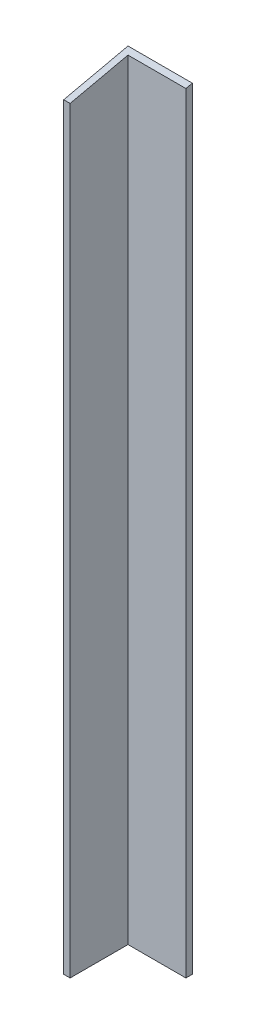
ISO-10303-21;
HEADER;
FILE_DESCRIPTION(('STEP AP214'),'2;1');
FILE_NAME('part.step','',(''),(''),'','','');
FILE_SCHEMA(('AUTOMOTIVE_DESIGN { 1 0 10303 214 1 1 1 1 }'));
ENDSEC;
DATA;
#1=APPLICATION_CONTEXT('core data for automotive mechanical design processes');
#2=APPLICATION_PROTOCOL_DEFINITION('international standard','automotive_design',2000,#1);
#3=PRODUCT_CONTEXT('',#1,'mechanical');
#4=PRODUCT('Part','Part','',(#3));
#5=PRODUCT_RELATED_PRODUCT_CATEGORY('part','',(#4));
#6=PRODUCT_DEFINITION_FORMATION('','',#4);
#7=PRODUCT_DEFINITION_CONTEXT('part definition',#1,'design');
#8=PRODUCT_DEFINITION('design','',#6,#7);
#9=PRODUCT_DEFINITION_SHAPE('','',#8);
#10=(LENGTH_UNIT() NAMED_UNIT(*) SI_UNIT(.MILLI.,.METRE.));
#11=(NAMED_UNIT(*) PLANE_ANGLE_UNIT() SI_UNIT($,.RADIAN.));
#12=(NAMED_UNIT(*) SI_UNIT($,.STERADIAN.) SOLID_ANGLE_UNIT());
#13=UNCERTAINTY_MEASURE_WITH_UNIT(LENGTH_MEASURE(1.E-05),#10,'distance_accuracy_value','');
#14=(GEOMETRIC_REPRESENTATION_CONTEXT(3) GLOBAL_UNCERTAINTY_ASSIGNED_CONTEXT((#13)) GLOBAL_UNIT_ASSIGNED_CONTEXT((#10,
#11,#12)) REPRESENTATION_CONTEXT('',''));
#15=CARTESIAN_POINT('',(0.,0.,0.));
#16=DIRECTION('',(0.,0.,1.));
#17=DIRECTION('',(1.,0.,0.));
#18=AXIS2_PLACEMENT_3D('',#15,#16,#17);
#19=CARTESIAN_POINT('',(-61.4626865671642,118.164179104478,-20.));
#20=DIRECTION('',(-1.,0.,0.));
#21=DIRECTION('',(0.,-1.,0.));
#22=AXIS2_PLACEMENT_3D('',#19,#20,#21);
#23=PLANE('',#22);
#24=DIRECTION('',(0.,-0.218143241396544,0.975916761938747));
#25=VECTOR('',#24,1.);
#26=CARTESIAN_POINT('',(-61.4626865671642,118.164179104478,-20.));
#27=LINE('',#26,#25);
#28=CARTESIAN_POINT('',(-61.4626865671642,118.164179104478,-20.));
#29=VERTEX_POINT('',#28);
#30=CARTESIAN_POINT('',(-61.4626865671642,113.693649446535,0.));
#31=VERTEX_POINT('',#30);
#32=EDGE_CURVE('E118',#29,#31,#27,.T.);
#33=ORIENTED_EDGE('',*,*,#32,.F.);
#34=DIRECTION('',(0.,-1.,0.));
#35=VECTOR('',#34,1.);
#36=CARTESIAN_POINT('',(-61.4626865671642,118.164179104478,-20.));
#37=LINE('',#36,#35);
#38=CARTESIAN_POINT('',(-61.4626865671642,-121.835820895522,-20.));
#39=VERTEX_POINT('',#38);
#40=EDGE_CURVE('E102',#29,#39,#37,.T.);
#41=ORIENTED_EDGE('',*,*,#40,.T.);
#42=DIRECTION('',(0.,0.,1.));
#43=VECTOR('',#42,1.);
#44=CARTESIAN_POINT('',(-61.4626865671642,-121.835820895522,-20.));
#45=LINE('',#44,#43);
#46=CARTESIAN_POINT('',(-61.4626865671642,-121.835820895522,0.));
#47=VERTEX_POINT('',#46);
#48=EDGE_CURVE('E112',#39,#47,#45,.T.);
#49=ORIENTED_EDGE('',*,*,#48,.T.);
#50=DIRECTION('',(0.,-1.,0.));
#51=VECTOR('',#50,1.);
#52=CARTESIAN_POINT('',(-61.4626865671642,118.164179104478,0.));
#53=LINE('',#52,#51);
#54=EDGE_CURVE('E100',#31,#47,#53,.T.);
#55=ORIENTED_EDGE('',*,*,#54,.F.);
#56=EDGE_LOOP('',(#33,#41,#49,#55));
#57=FACE_BOUND('',#56,.T.);
#58=ADVANCED_FACE('F33',(#57),#23,.T.);
#59=CARTESIAN_POINT('',(-41.4626865671642,118.164179104478,-20.));
#60=DIRECTION('',(1.,0.,0.));
#61=DIRECTION('',(0.,1.,0.));
#62=AXIS2_PLACEMENT_3D('',#59,#60,#61);
#63=PLANE('',#62);
#64=DIRECTION('',(0.,-1.,0.));
#65=VECTOR('',#64,1.);
#66=CARTESIAN_POINT('',(-41.4626865671648,168.164179104478,-18.));
#67=LINE('',#66,#65);
#68=CARTESIAN_POINT('',(-41.4626865671647,117.717126138683,-18.));
#69=VERTEX_POINT('',#68);
#70=CARTESIAN_POINT('',(-41.4626865671644,-121.835820895522,-18.));
#71=VERTEX_POINT('',#70);
#72=EDGE_CURVE('E133',#69,#71,#67,.T.);
#73=ORIENTED_EDGE('',*,*,#72,.T.);
#74=DIRECTION('',(0.,0.,1.));
#75=VECTOR('',#74,1.);
#76=CARTESIAN_POINT('',(-41.4626865671642,-121.835820895522,-20.));
#77=LINE('',#76,#75);
#78=CARTESIAN_POINT('',(-41.4626865671642,-121.835820895522,-20.));
#79=VERTEX_POINT('',#78);
#80=EDGE_CURVE('E110',#79,#71,#77,.T.);
#81=ORIENTED_EDGE('',*,*,#80,.F.);
#82=DIRECTION('',(0.,1.,0.));
#83=VECTOR('',#82,1.);
#84=CARTESIAN_POINT('',(-41.4626865671642,118.164179104478,-20.));
#85=LINE('',#84,#83);
#86=CARTESIAN_POINT('',(-41.4626865671642,118.164179104478,-20.));
#87=VERTEX_POINT('',#86);
#88=EDGE_CURVE('E126',#79,#87,#85,.T.);
#89=ORIENTED_EDGE('',*,*,#88,.T.);
#90=DIRECTION('',(0.,-0.218143241396544,0.975916761938747));
#91=VECTOR('',#90,1.);
#92=CARTESIAN_POINT('',(-41.4626865671642,118.164179104478,-20.));
#93=LINE('',#92,#91);
#94=EDGE_CURVE('E119',#87,#69,#93,.T.);
#95=ORIENTED_EDGE('',*,*,#94,.T.);
#96=EDGE_LOOP('',(#73,#81,#89,#95));
#97=FACE_BOUND('',#96,.T.);
#98=ADVANCED_FACE('F138',(#97),#63,.T.);
#99=CARTESIAN_POINT('',(-61.4626865671642,-121.835820895522,-20.));
#100=DIRECTION('',(0.,-1.,0.));
#101=DIRECTION('',(0.,0.,-1.));
#102=AXIS2_PLACEMENT_3D('',#99,#100,#101);
#103=PLANE('',#102);
#104=DIRECTION('',(1.,0.,0.));
#105=VECTOR('',#104,1.);
#106=CARTESIAN_POINT('',(-41.4626865671644,-121.835820895522,-18.));
#107=LINE('',#106,#105);
#108=CARTESIAN_POINT('',(-59.4626865671644,-121.835820895522,-18.));
#109=VERTEX_POINT('',#108);
#110=EDGE_CURVE('E90',#109,#71,#107,.T.);
#111=ORIENTED_EDGE('',*,*,#110,.F.);
#112=DIRECTION('',(0.,0.,-1.));
#113=VECTOR('',#112,1.);
#114=CARTESIAN_POINT('',(-59.4626865671644,-121.835820895522,0.));
#115=LINE('',#114,#113);
#116=CARTESIAN_POINT('',(-59.4626865671644,-121.835820895522,0.));
#117=VERTEX_POINT('',#116);
#118=EDGE_CURVE('E86',#117,#109,#115,.T.);
#119=ORIENTED_EDGE('',*,*,#118,.F.);
#120=DIRECTION('',(1.,0.,0.));
#121=VECTOR('',#120,1.);
#122=CARTESIAN_POINT('',(-61.4626865671642,-121.835820895522,0.));
#123=LINE('',#122,#121);
#124=EDGE_CURVE('E95',#47,#117,#123,.T.);
#125=ORIENTED_EDGE('',*,*,#124,.F.);
#126=ORIENTED_EDGE('',*,*,#48,.F.);
#127=DIRECTION('',(1.,0.,0.));
#128=VECTOR('',#127,1.);
#129=CARTESIAN_POINT('',(-61.4626865671642,-121.835820895522,-20.));
#130=LINE('',#129,#128);
#131=EDGE_CURVE('E105',#39,#79,#130,.T.);
#132=ORIENTED_EDGE('',*,*,#131,.T.);
#133=ORIENTED_EDGE('',*,*,#80,.T.);
#134=EDGE_LOOP('',(#111,#119,#125,#126,#132,#133));
#135=FACE_BOUND('',#134,.T.);
#136=ADVANCED_FACE('F94',(#135),#103,.T.);
#137=CARTESIAN_POINT('',(0.,0.,-20.));
#138=DIRECTION('',(0.,0.,1.));
#139=DIRECTION('',(1.,0.,0.));
#140=AXIS2_PLACEMENT_3D('',#137,#138,#139);
#141=PLANE('',#140);
#142=ORIENTED_EDGE('',*,*,#40,.F.);
#143=DIRECTION('',(-1.,0.,0.));
#144=VECTOR('',#143,1.);
#145=CARTESIAN_POINT('',(-61.4626865671642,118.164179104478,-20.));
#146=LINE('',#145,#144);
#147=EDGE_CURVE('E113',#87,#29,#146,.T.);
#148=ORIENTED_EDGE('',*,*,#147,.F.);
#149=ORIENTED_EDGE('',*,*,#88,.F.);
#150=ORIENTED_EDGE('',*,*,#131,.F.);
#151=EDGE_LOOP('',(#142,#148,#149,#150));
#152=FACE_BOUND('',#151,.T.);
#153=ADVANCED_FACE('F135',(#152),#141,.F.);
#154=CARTESIAN_POINT('',(0.,0.,0.));
#155=DIRECTION('',(0.,0.,1.));
#156=DIRECTION('',(1.,0.,0.));
#157=AXIS2_PLACEMENT_3D('',#154,#155,#156);
#158=PLANE('',#157);
#159=DIRECTION('',(0.,-1.,0.));
#160=VECTOR('',#159,1.);
#161=CARTESIAN_POINT('',(-59.4626865671648,168.164179104478,0.));
#162=LINE('',#161,#160);
#163=CARTESIAN_POINT('',(-59.4626865671647,113.693649446535,0.));
#164=VERTEX_POINT('',#163);
#165=EDGE_CURVE('E83',#164,#117,#162,.T.);
#166=ORIENTED_EDGE('',*,*,#165,.F.);
#167=DIRECTION('',(-1.,0.,0.));
#168=VECTOR('',#167,1.);
#169=CARTESIAN_POINT('',(-41.4626865671642,113.693649446535,0.));
#170=LINE('',#169,#168);
#171=EDGE_CURVE('E55',#164,#31,#170,.T.);
#172=ORIENTED_EDGE('',*,*,#171,.T.);
#173=ORIENTED_EDGE('',*,*,#54,.T.);
#174=ORIENTED_EDGE('',*,*,#124,.T.);
#175=EDGE_LOOP('',(#166,#172,#173,#174));
#176=FACE_BOUND('',#175,.T.);
#177=ADVANCED_FACE('F98',(#176),#158,.T.);
#178=CARTESIAN_POINT('',(-41.4626865671642,118.164179104478,-20.));
#179=DIRECTION('',(0.,-0.975916761938747,-0.218143241396544));
#180=DIRECTION('',(0.,0.218143241396544,-0.975916761938747));
#181=AXIS2_PLACEMENT_3D('',#178,#179,#180);
#182=PLANE('',#181);
#183=DIRECTION('',(0.,0.218143241396544,-0.975916761938747));
#184=VECTOR('',#183,1.);
#185=CARTESIAN_POINT('',(-59.4626865671647,118.164179104478,-20.));
#186=LINE('',#185,#184);
#187=CARTESIAN_POINT('',(-59.4626865671647,117.717126138683,-18.));
#188=VERTEX_POINT('',#187);
#189=EDGE_CURVE('E40',#164,#188,#186,.T.);
#190=ORIENTED_EDGE('',*,*,#189,.T.);
#191=DIRECTION('',(1.,0.,0.));
#192=VECTOR('',#191,1.);
#193=CARTESIAN_POINT('',(-41.4626865671642,117.717126138683,-18.));
#194=LINE('',#193,#192);
#195=EDGE_CURVE('E11',#188,#69,#194,.T.);
#196=ORIENTED_EDGE('',*,*,#195,.T.);
#197=ORIENTED_EDGE('',*,*,#94,.F.);
#198=ORIENTED_EDGE('',*,*,#147,.T.);
#199=ORIENTED_EDGE('',*,*,#32,.T.);
#200=ORIENTED_EDGE('',*,*,#171,.F.);
#201=EDGE_LOOP('',(#190,#196,#197,#198,#199,#200));
#202=FACE_BOUND('',#201,.T.);
#203=ADVANCED_FACE('F115',(#202),#182,.F.);
#204=CARTESIAN_POINT('',(-41.4626865671648,168.164179104478,-18.));
#205=DIRECTION('',(0.,0.,-1.));
#206=DIRECTION('',(-1.,0.,0.));
#207=AXIS2_PLACEMENT_3D('',#204,#205,#206);
#208=PLANE('',#207);
#209=DIRECTION('',(0.,-1.,0.));
#210=VECTOR('',#209,1.);
#211=CARTESIAN_POINT('',(-59.4626865671648,168.164179104478,-18.));
#212=LINE('',#211,#210);
#213=EDGE_CURVE('E47',#188,#109,#212,.T.);
#214=ORIENTED_EDGE('',*,*,#213,.T.);
#215=ORIENTED_EDGE('',*,*,#110,.T.);
#216=ORIENTED_EDGE('',*,*,#72,.F.);
#217=ORIENTED_EDGE('',*,*,#195,.F.);
#218=EDGE_LOOP('',(#214,#215,#216,#217));
#219=FACE_BOUND('',#218,.T.);
#220=ADVANCED_FACE('F143',(#219),#208,.F.);
#221=CARTESIAN_POINT('',(-59.4626865671648,168.164179104478,0.));
#222=DIRECTION('',(-1.,0.,0.));
#223=DIRECTION('',(0.,-1.,0.));
#224=AXIS2_PLACEMENT_3D('',#221,#222,#223);
#225=PLANE('',#224);
#226=ORIENTED_EDGE('',*,*,#165,.T.);
#227=ORIENTED_EDGE('',*,*,#118,.T.);
#228=ORIENTED_EDGE('',*,*,#213,.F.);
#229=ORIENTED_EDGE('',*,*,#189,.F.);
#230=EDGE_LOOP('',(#226,#227,#228,#229));
#231=FACE_BOUND('',#230,.T.);
#232=ADVANCED_FACE('F85',(#231),#225,.F.);
#233=CLOSED_SHELL('',(#58,#98,#136,#153,#177,#203,#220,#232));
#234=MANIFOLD_SOLID_BREP('B2',#233);
#235=ADVANCED_BREP_SHAPE_REPRESENTATION('',(#18,#234),#14);
#236=SHAPE_DEFINITION_REPRESENTATION(#9,#235);
ENDSEC;
END-ISO-10303-21;
